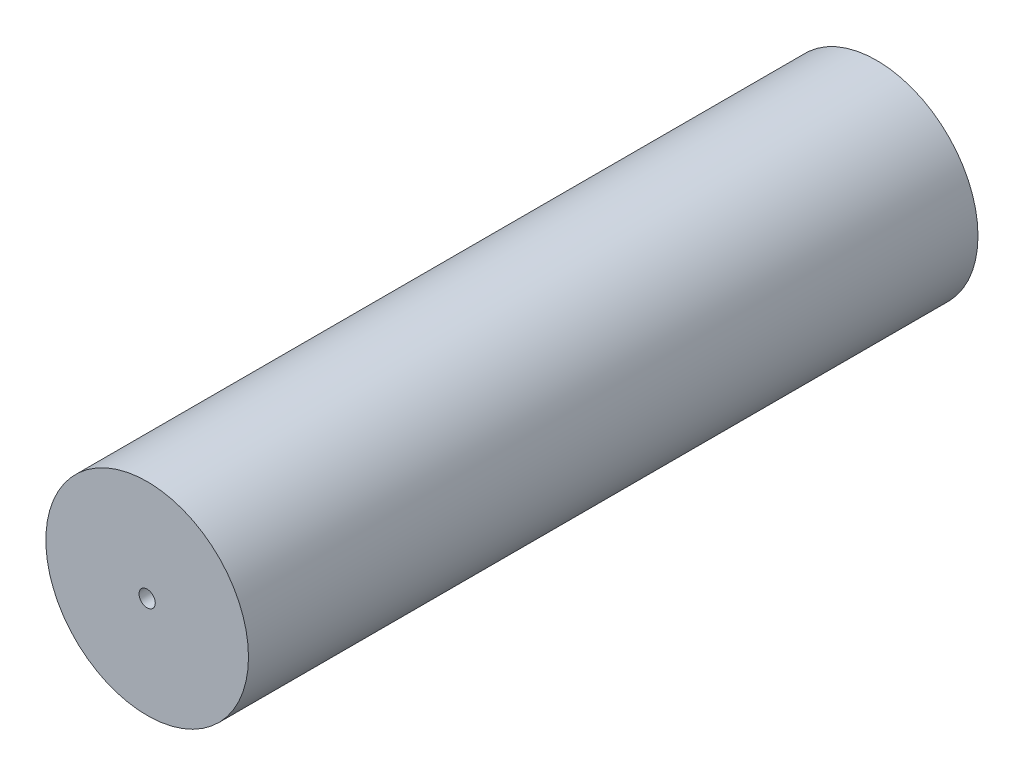
ISO-10303-21;
HEADER;
FILE_DESCRIPTION(('STEP AP214'),'2;1');
FILE_NAME('part.step','',(''),(''),'','','');
FILE_SCHEMA(('AUTOMOTIVE_DESIGN { 1 0 10303 214 1 1 1 1 }'));
ENDSEC;
DATA;
#1=APPLICATION_CONTEXT('core data for automotive mechanical design processes');
#2=APPLICATION_PROTOCOL_DEFINITION('international standard','automotive_design',2000,#1);
#3=PRODUCT_CONTEXT('',#1,'mechanical');
#4=PRODUCT('Part','Part','',(#3));
#5=PRODUCT_RELATED_PRODUCT_CATEGORY('part','',(#4));
#6=PRODUCT_DEFINITION_FORMATION('','',#4);
#7=PRODUCT_DEFINITION_CONTEXT('part definition',#1,'design');
#8=PRODUCT_DEFINITION('design','',#6,#7);
#9=PRODUCT_DEFINITION_SHAPE('','',#8);
#10=(LENGTH_UNIT() NAMED_UNIT(*) SI_UNIT(.MILLI.,.METRE.));
#11=(NAMED_UNIT(*) PLANE_ANGLE_UNIT() SI_UNIT($,.RADIAN.));
#12=(NAMED_UNIT(*) SI_UNIT($,.STERADIAN.) SOLID_ANGLE_UNIT());
#13=UNCERTAINTY_MEASURE_WITH_UNIT(LENGTH_MEASURE(1.E-05),#10,'distance_accuracy_value','');
#14=(GEOMETRIC_REPRESENTATION_CONTEXT(3) GLOBAL_UNCERTAINTY_ASSIGNED_CONTEXT((#13)) GLOBAL_UNIT_ASSIGNED_CONTEXT((#10,
#11,#12)) REPRESENTATION_CONTEXT('',''));
#15=CARTESIAN_POINT('',(0.,0.,0.));
#16=DIRECTION('',(0.,0.,1.));
#17=DIRECTION('',(1.,0.,0.));
#18=AXIS2_PLACEMENT_3D('',#15,#16,#17);
#19=CARTESIAN_POINT('',(0.,0.,900.));
#20=DIRECTION('',(0.,0.,-1.));
#21=DIRECTION('',(-1.,0.,0.));
#22=AXIS2_PLACEMENT_3D('',#19,#20,#21);
#23=CYLINDRICAL_SURFACE('',#22,125.);
#24=CARTESIAN_POINT('',(0.,0.,900.));
#25=DIRECTION('',(0.,0.,1.));
#26=DIRECTION('',(1.,0.,0.));
#27=AXIS2_PLACEMENT_3D('',#24,#25,#26);
#28=CIRCLE('',#27,125.);
#29=CARTESIAN_POINT('',(125.,0.,900.));
#30=VERTEX_POINT('',#29);
#31=EDGE_CURVE('E10',#30,#30,#28,.T.);
#32=ORIENTED_EDGE('',*,*,#31,.F.);
#33=EDGE_LOOP('',(#32));
#34=FACE_BOUND('',#33,.T.);
#35=CARTESIAN_POINT('',(0.,0.,0.));
#36=DIRECTION('',(0.,0.,1.));
#37=DIRECTION('',(1.,0.,0.));
#38=AXIS2_PLACEMENT_3D('',#35,#36,#37);
#39=CIRCLE('',#38,125.);
#40=CARTESIAN_POINT('',(125.,0.,0.));
#41=VERTEX_POINT('',#40);
#42=EDGE_CURVE('E34',#41,#41,#39,.T.);
#43=ORIENTED_EDGE('',*,*,#42,.T.);
#44=EDGE_LOOP('',(#43));
#45=FACE_BOUND('',#44,.T.);
#46=ADVANCED_FACE('F31',(#34,#45),#23,.T.);
#47=CARTESIAN_POINT('',(0.,0.,900.));
#48=DIRECTION('',(0.,0.,1.));
#49=DIRECTION('',(1.,0.,0.));
#50=AXIS2_PLACEMENT_3D('',#47,#48,#49);
#51=PLANE('',#50);
#52=CARTESIAN_POINT('',(0.,0.,900.));
#53=DIRECTION('',(0.,0.,1.));
#54=DIRECTION('',(1.,0.,0.));
#55=AXIS2_PLACEMENT_3D('',#52,#53,#54);
#56=CIRCLE('',#55,10.);
#57=CARTESIAN_POINT('',(10.,0.,900.));
#58=VERTEX_POINT('',#57);
#59=EDGE_CURVE('E43',#58,#58,#56,.T.);
#60=ORIENTED_EDGE('',*,*,#59,.F.);
#61=EDGE_LOOP('',(#60));
#62=FACE_BOUND('',#61,.T.);
#63=ORIENTED_EDGE('',*,*,#31,.T.);
#64=EDGE_LOOP('',(#63));
#65=FACE_BOUND('',#64,.T.);
#66=ADVANCED_FACE('F68',(#62,#65),#51,.T.);
#67=CARTESIAN_POINT('',(0.,0.,0.));
#68=DIRECTION('',(0.,0.,1.));
#69=DIRECTION('',(1.,0.,0.));
#70=AXIS2_PLACEMENT_3D('',#67,#68,#69);
#71=PLANE('',#70);
#72=CARTESIAN_POINT('',(0.,0.,0.));
#73=DIRECTION('',(0.,0.,-1.));
#74=DIRECTION('',(-1.,0.,0.));
#75=AXIS2_PLACEMENT_3D('',#72,#73,#74);
#76=CIRCLE('',#75,10.);
#77=CARTESIAN_POINT('',(-10.,0.,0.));
#78=VERTEX_POINT('',#77);
#79=EDGE_CURVE('E49',#78,#78,#76,.T.);
#80=ORIENTED_EDGE('',*,*,#79,.F.);
#81=EDGE_LOOP('',(#80));
#82=FACE_BOUND('',#81,.T.);
#83=ORIENTED_EDGE('',*,*,#42,.F.);
#84=EDGE_LOOP('',(#83));
#85=FACE_BOUND('',#84,.T.);
#86=ADVANCED_FACE('F64',(#82,#85),#71,.F.);
#87=CARTESIAN_POINT('',(0.,0.,550.));
#88=DIRECTION('',(0.,0.,1.));
#89=DIRECTION('',(1.,0.,0.));
#90=AXIS2_PLACEMENT_3D('',#87,#88,#89);
#91=CYLINDRICAL_SURFACE('',#90,10.);
#92=CARTESIAN_POINT('',(0.,0.,550.));
#93=DIRECTION('',(0.,0.,1.));
#94=DIRECTION('',(1.,0.,0.));
#95=AXIS2_PLACEMENT_3D('',#92,#93,#94);
#96=CIRCLE('',#95,10.);
#97=CARTESIAN_POINT('',(10.,0.,550.));
#98=VERTEX_POINT('',#97);
#99=EDGE_CURVE('E41',#98,#98,#96,.T.);
#100=ORIENTED_EDGE('',*,*,#99,.F.);
#101=EDGE_LOOP('',(#100));
#102=FACE_BOUND('',#101,.T.);
#103=ORIENTED_EDGE('',*,*,#59,.T.);
#104=EDGE_LOOP('',(#103));
#105=FACE_BOUND('',#104,.T.);
#106=ADVANCED_FACE('F67',(#102,#105),#91,.F.);
#107=CARTESIAN_POINT('',(0.,0.,550.));
#108=DIRECTION('',(0.,0.,1.));
#109=DIRECTION('',(1.,0.,0.));
#110=AXIS2_PLACEMENT_3D('',#107,#108,#109);
#111=PLANE('',#110);
#112=ORIENTED_EDGE('',*,*,#99,.T.);
#113=EDGE_LOOP('',(#112));
#114=FACE_BOUND('',#113,.T.);
#115=ADVANCED_FACE('F60',(#114),#111,.T.);
#116=CARTESIAN_POINT('',(0.,0.,400.));
#117=DIRECTION('',(0.,0.,-1.));
#118=DIRECTION('',(-1.,0.,0.));
#119=AXIS2_PLACEMENT_3D('',#116,#117,#118);
#120=CYLINDRICAL_SURFACE('',#119,10.);
#121=CARTESIAN_POINT('',(0.,0.,400.));
#122=DIRECTION('',(0.,0.,-1.));
#123=DIRECTION('',(-1.,0.,0.));
#124=AXIS2_PLACEMENT_3D('',#121,#122,#123);
#125=CIRCLE('',#124,10.);
#126=CARTESIAN_POINT('',(-10.,0.,400.));
#127=VERTEX_POINT('',#126);
#128=EDGE_CURVE('E46',#127,#127,#125,.T.);
#129=ORIENTED_EDGE('',*,*,#128,.F.);
#130=EDGE_LOOP('',(#129));
#131=FACE_BOUND('',#130,.T.);
#132=ORIENTED_EDGE('',*,*,#79,.T.);
#133=EDGE_LOOP('',(#132));
#134=FACE_BOUND('',#133,.T.);
#135=ADVANCED_FACE('F57',(#131,#134),#120,.F.);
#136=CARTESIAN_POINT('',(0.,0.,400.));
#137=DIRECTION('',(0.,0.,-1.));
#138=DIRECTION('',(-1.,0.,0.));
#139=AXIS2_PLACEMENT_3D('',#136,#137,#138);
#140=PLANE('',#139);
#141=ORIENTED_EDGE('',*,*,#128,.T.);
#142=EDGE_LOOP('',(#141));
#143=FACE_BOUND('',#142,.T.);
#144=ADVANCED_FACE('F55',(#143),#140,.T.);
#145=CLOSED_SHELL('',(#46,#66,#86,#106,#115,#135,#144));
#146=MANIFOLD_SOLID_BREP('B2',#145);
#147=ADVANCED_BREP_SHAPE_REPRESENTATION('',(#18,#146),#14);
#148=SHAPE_DEFINITION_REPRESENTATION(#9,#147);
ENDSEC;
END-ISO-10303-21;
